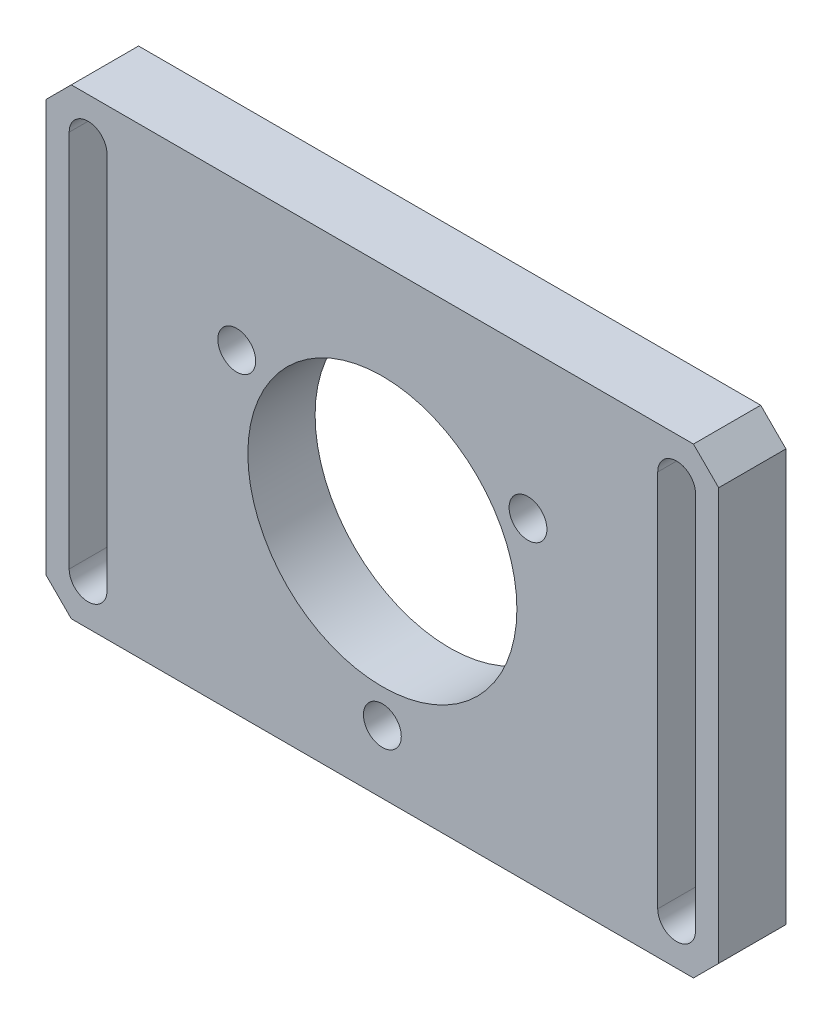
ISO-10303-21;
HEADER;
FILE_DESCRIPTION(('STEP AP214'),'2;1');
FILE_NAME('part.step','',(''),(''),'','','');
FILE_SCHEMA(('AUTOMOTIVE_DESIGN { 1 0 10303 214 1 1 1 1 }'));
ENDSEC;
DATA;
#1=APPLICATION_CONTEXT('core data for automotive mechanical design processes');
#2=APPLICATION_PROTOCOL_DEFINITION('international standard','automotive_design',2000,#1);
#3=PRODUCT_CONTEXT('',#1,'mechanical');
#4=PRODUCT('Part','Part','',(#3));
#5=PRODUCT_RELATED_PRODUCT_CATEGORY('part','',(#4));
#6=PRODUCT_DEFINITION_FORMATION('','',#4);
#7=PRODUCT_DEFINITION_CONTEXT('part definition',#1,'design');
#8=PRODUCT_DEFINITION('design','',#6,#7);
#9=PRODUCT_DEFINITION_SHAPE('','',#8);
#10=(LENGTH_UNIT() NAMED_UNIT(*) SI_UNIT(.MILLI.,.METRE.));
#11=(NAMED_UNIT(*) PLANE_ANGLE_UNIT() SI_UNIT($,.RADIAN.));
#12=(NAMED_UNIT(*) SI_UNIT($,.STERADIAN.) SOLID_ANGLE_UNIT());
#13=UNCERTAINTY_MEASURE_WITH_UNIT(LENGTH_MEASURE(1.E-05),#10,'distance_accuracy_value','');
#14=(GEOMETRIC_REPRESENTATION_CONTEXT(3) GLOBAL_UNCERTAINTY_ASSIGNED_CONTEXT((#13)) GLOBAL_UNIT_ASSIGNED_CONTEXT((#10,
#11,#12)) REPRESENTATION_CONTEXT('',''));
#15=CARTESIAN_POINT('',(0.,0.,0.));
#16=DIRECTION('',(0.,0.,1.));
#17=DIRECTION('',(1.,0.,0.));
#18=AXIS2_PLACEMENT_3D('',#15,#16,#17);
#19=CARTESIAN_POINT('',(-29.6552919780773,16.2728929963228,-8.));
#20=DIRECTION('',(-1.,0.,0.));
#21=DIRECTION('',(0.,-1.,0.));
#22=AXIS2_PLACEMENT_3D('',#19,#20,#21);
#23=PLANE('',#22);
#24=DIRECTION('',(0.,-1.,0.));
#25=VECTOR('',#24,1.);
#26=CARTESIAN_POINT('',(-29.6552919780773,16.2728929963228,-8.));
#27=LINE('',#26,#25);
#28=CARTESIAN_POINT('',(-29.6552919780773,13.2728929963228,-8.));
#29=VERTEX_POINT('',#28);
#30=CARTESIAN_POINT('',(-29.6552919780772,-35.7271070036772,-8.));
#31=VERTEX_POINT('',#30);
#32=EDGE_CURVE('E234',#29,#31,#27,.T.);
#33=ORIENTED_EDGE('',*,*,#32,.T.);
#34=DIRECTION('',(0.,0.,1.));
#35=VECTOR('',#34,1.);
#36=CARTESIAN_POINT('',(-29.6552919780772,-35.7271070036772,-8.));
#37=LINE('',#36,#35);
#38=CARTESIAN_POINT('',(-29.6552919780772,-35.7271070036772,0.));
#39=VERTEX_POINT('',#38);
#40=EDGE_CURVE('E11',#31,#39,#37,.T.);
#41=ORIENTED_EDGE('',*,*,#40,.T.);
#42=DIRECTION('',(0.,-1.,0.));
#43=VECTOR('',#42,1.);
#44=CARTESIAN_POINT('',(-29.6552919780773,16.2728929963228,0.));
#45=LINE('',#44,#43);
#46=CARTESIAN_POINT('',(-29.6552919780773,13.2728929963228,0.));
#47=VERTEX_POINT('',#46);
#48=EDGE_CURVE('E231',#47,#39,#45,.T.);
#49=ORIENTED_EDGE('',*,*,#48,.F.);
#50=DIRECTION('',(0.,0.,-1.));
#51=VECTOR('',#50,1.);
#52=CARTESIAN_POINT('',(-29.6552919780773,13.2728929963228,-8.));
#53=LINE('',#52,#51);
#54=EDGE_CURVE('E41',#47,#29,#53,.T.);
#55=ORIENTED_EDGE('',*,*,#54,.T.);
#56=EDGE_LOOP('',(#33,#41,#49,#55));
#57=FACE_BOUND('',#56,.T.);
#58=ADVANCED_FACE('F33',(#57),#23,.T.);
#59=CARTESIAN_POINT('',(-29.6552919780773,16.2728929963228,-8.));
#60=DIRECTION('',(0.,1.,0.));
#61=DIRECTION('',(0.,0.,1.));
#62=AXIS2_PLACEMENT_3D('',#59,#60,#61);
#63=PLANE('',#62);
#64=DIRECTION('',(-1.,0.,0.));
#65=VECTOR('',#64,1.);
#66=CARTESIAN_POINT('',(-29.6552919780773,16.2728929963228,0.));
#67=LINE('',#66,#65);
#68=CARTESIAN_POINT('',(47.3447080219227,16.2728929963228,0.));
#69=VERTEX_POINT('',#68);
#70=CARTESIAN_POINT('',(-26.6552919780772,16.2728929963228,0.));
#71=VERTEX_POINT('',#70);
#72=EDGE_CURVE('E238',#69,#71,#67,.T.);
#73=ORIENTED_EDGE('',*,*,#72,.F.);
#74=DIRECTION('',(0.,0.,-1.));
#75=VECTOR('',#74,1.);
#76=CARTESIAN_POINT('',(47.3447080219227,16.2728929963228,-8.));
#77=LINE('',#76,#75);
#78=CARTESIAN_POINT('',(47.3447080219227,16.2728929963228,-8.));
#79=VERTEX_POINT('',#78);
#80=EDGE_CURVE('E272',#69,#79,#77,.T.);
#81=ORIENTED_EDGE('',*,*,#80,.T.);
#82=DIRECTION('',(-1.,0.,0.));
#83=VECTOR('',#82,1.);
#84=CARTESIAN_POINT('',(-29.6552919780773,16.2728929963228,-8.));
#85=LINE('',#84,#83);
#86=CARTESIAN_POINT('',(-26.6552919780772,16.2728929963228,-8.));
#87=VERTEX_POINT('',#86);
#88=EDGE_CURVE('E243',#79,#87,#85,.T.);
#89=ORIENTED_EDGE('',*,*,#88,.T.);
#90=DIRECTION('',(0.,0.,1.));
#91=VECTOR('',#90,1.);
#92=CARTESIAN_POINT('',(-26.6552919780772,16.2728929963228,-8.));
#93=LINE('',#92,#91);
#94=EDGE_CURVE('E269',#87,#71,#93,.T.);
#95=ORIENTED_EDGE('',*,*,#94,.T.);
#96=EDGE_LOOP('',(#73,#81,#89,#95));
#97=FACE_BOUND('',#96,.T.);
#98=ADVANCED_FACE('F296',(#97),#63,.T.);
#99=CARTESIAN_POINT('',(50.3447080219227,16.2728929963228,-8.));
#100=DIRECTION('',(1.,0.,0.));
#101=DIRECTION('',(0.,1.,0.));
#102=AXIS2_PLACEMENT_3D('',#99,#100,#101);
#103=PLANE('',#102);
#104=DIRECTION('',(0.,1.,0.));
#105=VECTOR('',#104,1.);
#106=CARTESIAN_POINT('',(50.3447080219227,16.2728929963228,-8.));
#107=LINE('',#106,#105);
#108=CARTESIAN_POINT('',(50.3447080219227,-35.7271070036772,-8.));
#109=VERTEX_POINT('',#108);
#110=CARTESIAN_POINT('',(50.3447080219227,13.2728929963228,-8.));
#111=VERTEX_POINT('',#110);
#112=EDGE_CURVE('E240',#109,#111,#107,.T.);
#113=ORIENTED_EDGE('',*,*,#112,.T.);
#114=DIRECTION('',(0.,0.,1.));
#115=VECTOR('',#114,1.);
#116=CARTESIAN_POINT('',(50.3447080219227,13.2728929963228,-8.));
#117=LINE('',#116,#115);
#118=CARTESIAN_POINT('',(50.3447080219227,13.2728929963228,0.));
#119=VERTEX_POINT('',#118);
#120=EDGE_CURVE('E258',#111,#119,#117,.T.);
#121=ORIENTED_EDGE('',*,*,#120,.T.);
#122=DIRECTION('',(0.,1.,0.));
#123=VECTOR('',#122,1.);
#124=CARTESIAN_POINT('',(50.3447080219227,16.2728929963228,0.));
#125=LINE('',#124,#123);
#126=CARTESIAN_POINT('',(50.3447080219227,-35.7271070036772,0.));
#127=VERTEX_POINT('',#126);
#128=EDGE_CURVE('E252',#127,#119,#125,.T.);
#129=ORIENTED_EDGE('',*,*,#128,.F.);
#130=DIRECTION('',(0.,0.,-1.));
#131=VECTOR('',#130,1.);
#132=CARTESIAN_POINT('',(50.3447080219227,-35.7271070036772,-8.));
#133=LINE('',#132,#131);
#134=EDGE_CURVE('E246',#127,#109,#133,.T.);
#135=ORIENTED_EDGE('',*,*,#134,.T.);
#136=EDGE_LOOP('',(#113,#121,#129,#135));
#137=FACE_BOUND('',#136,.T.);
#138=ADVANCED_FACE('F306',(#137),#103,.T.);
#139=CARTESIAN_POINT('',(-29.6552919780772,-38.7271070036772,-8.));
#140=DIRECTION('',(0.,-1.,0.));
#141=DIRECTION('',(0.,0.,-1.));
#142=AXIS2_PLACEMENT_3D('',#139,#140,#141);
#143=PLANE('',#142);
#144=DIRECTION('',(1.,0.,0.));
#145=VECTOR('',#144,1.);
#146=CARTESIAN_POINT('',(-29.6552919780772,-38.7271070036772,-8.));
#147=LINE('',#146,#145);
#148=CARTESIAN_POINT('',(-26.6552919780772,-38.7271070036772,-8.));
#149=VERTEX_POINT('',#148);
#150=CARTESIAN_POINT('',(47.3447080219227,-38.7271070036772,-8.));
#151=VERTEX_POINT('',#150);
#152=EDGE_CURVE('E237',#149,#151,#147,.T.);
#153=ORIENTED_EDGE('',*,*,#152,.T.);
#154=DIRECTION('',(0.,0.,1.));
#155=VECTOR('',#154,1.);
#156=CARTESIAN_POINT('',(47.3447080219227,-38.7271070036772,-8.));
#157=LINE('',#156,#155);
#158=CARTESIAN_POINT('',(47.3447080219227,-38.7271070036772,0.));
#159=VERTEX_POINT('',#158);
#160=EDGE_CURVE('E282',#151,#159,#157,.T.);
#161=ORIENTED_EDGE('',*,*,#160,.T.);
#162=DIRECTION('',(1.,0.,0.));
#163=VECTOR('',#162,1.);
#164=CARTESIAN_POINT('',(-29.6552919780772,-38.7271070036772,0.));
#165=LINE('',#164,#163);
#166=CARTESIAN_POINT('',(-26.6552919780772,-38.7271070036772,0.));
#167=VERTEX_POINT('',#166);
#168=EDGE_CURVE('E249',#167,#159,#165,.T.);
#169=ORIENTED_EDGE('',*,*,#168,.F.);
#170=DIRECTION('',(0.,0.,-1.));
#171=VECTOR('',#170,1.);
#172=CARTESIAN_POINT('',(-26.6552919780772,-38.7271070036772,-8.));
#173=LINE('',#172,#171);
#174=EDGE_CURVE('E55',#167,#149,#173,.T.);
#175=ORIENTED_EDGE('',*,*,#174,.T.);
#176=EDGE_LOOP('',(#153,#161,#169,#175));
#177=FACE_BOUND('',#176,.T.);
#178=ADVANCED_FACE('F311',(#177),#143,.T.);
#179=CARTESIAN_POINT('',(0.,0.,-8.));
#180=DIRECTION('',(0.,0.,1.));
#181=DIRECTION('',(1.,0.,0.));
#182=AXIS2_PLACEMENT_3D('',#179,#180,#181);
#183=PLANE('',#182);
#184=CARTESIAN_POINT('',(27.6652160976116,-1.22710700367738,-8.));
#185=DIRECTION('',(0.,0.,1.));
#186=DIRECTION('',(-0.499999999999992,0.866025403784443,0.));
#187=AXIS2_PLACEMENT_3D('',#184,#185,#186);
#188=CIRCLE('',#187,2.25);
#189=CARTESIAN_POINT('',(26.5402160976116,0.721450154837616,-8.));
#190=VERTEX_POINT('',#189);
#191=EDGE_CURVE('E546',#190,#190,#188,.T.);
#192=ORIENTED_EDGE('',*,*,#191,.T.);
#193=EDGE_LOOP('',(#192));
#194=FACE_BOUND('',#193,.T.);
#195=CARTESIAN_POINT('',(-6.97580005376599,-1.22710700367714,-8.));
#196=DIRECTION('',(0.,0.,1.));
#197=DIRECTION('',(-0.500000000000004,-0.866025403784436,0.));
#198=AXIS2_PLACEMENT_3D('',#195,#196,#197);
#199=CIRCLE('',#198,2.25);
#200=CARTESIAN_POINT('',(-8.100800053766,-3.17566416219212,-8.));
#201=VERTEX_POINT('',#200);
#202=EDGE_CURVE('E540',#201,#201,#199,.T.);
#203=ORIENTED_EDGE('',*,*,#202,.T.);
#204=EDGE_LOOP('',(#203));
#205=FACE_BOUND('',#204,.T.);
#206=CARTESIAN_POINT('',(10.3447080219227,-31.2271070036772,-8.));
#207=DIRECTION('',(0.,0.,1.));
#208=DIRECTION('',(1.,0.,0.));
#209=AXIS2_PLACEMENT_3D('',#206,#207,#208);
#210=CIRCLE('',#209,2.25);
#211=CARTESIAN_POINT('',(12.5947080219228,-31.2271070036772,-8.));
#212=VERTEX_POINT('',#211);
#213=EDGE_CURVE('E186',#212,#212,#210,.T.);
#214=ORIENTED_EDGE('',*,*,#213,.T.);
#215=EDGE_LOOP('',(#214));
#216=FACE_BOUND('',#215,.T.);
#217=DIRECTION('',(0.,1.,0.));
#218=VECTOR('',#217,1.);
#219=CARTESIAN_POINT('',(47.5947080219228,11.2728929963228,-8.));
#220=LINE('',#219,#218);
#221=CARTESIAN_POINT('',(47.5947080219228,-33.7271070036772,-8.));
#222=VERTEX_POINT('',#221);
#223=CARTESIAN_POINT('',(47.5947080219228,11.2728929963228,-8.));
#224=VERTEX_POINT('',#223);
#225=EDGE_CURVE('E160',#222,#224,#220,.T.);
#226=ORIENTED_EDGE('',*,*,#225,.T.);
#227=CARTESIAN_POINT('',(45.3447080219228,11.2728929963228,-8.));
#228=DIRECTION('',(0.,0.,1.));
#229=DIRECTION('',(1.,0.,0.));
#230=AXIS2_PLACEMENT_3D('',#227,#228,#229);
#231=CIRCLE('',#230,2.25);
#232=CARTESIAN_POINT('',(43.0947080219227,11.2728929963228,-8.));
#233=VERTEX_POINT('',#232);
#234=EDGE_CURVE('E152',#224,#233,#231,.T.);
#235=ORIENTED_EDGE('',*,*,#234,.T.);
#236=DIRECTION('',(0.,-1.,0.));
#237=VECTOR('',#236,1.);
#238=CARTESIAN_POINT('',(43.0947080219227,11.2728929963228,-8.));
#239=LINE('',#238,#237);
#240=CARTESIAN_POINT('',(43.0947080219227,-33.7271070036772,-8.));
#241=VERTEX_POINT('',#240);
#242=EDGE_CURVE('E164',#233,#241,#239,.T.);
#243=ORIENTED_EDGE('',*,*,#242,.T.);
#244=CARTESIAN_POINT('',(45.3447080219228,-33.7271070036772,-8.));
#245=DIRECTION('',(0.,0.,1.));
#246=DIRECTION('',(1.,0.,0.));
#247=AXIS2_PLACEMENT_3D('',#244,#245,#246);
#248=CIRCLE('',#247,2.25000000000001);
#249=EDGE_CURVE('E168',#241,#222,#248,.T.);
#250=ORIENTED_EDGE('',*,*,#249,.T.);
#251=EDGE_LOOP('',(#226,#235,#243,#250));
#252=FACE_BOUND('',#251,.T.);
#253=DIRECTION('',(0.,1.,0.));
#254=VECTOR('',#253,1.);
#255=CARTESIAN_POINT('',(-22.4052919780773,11.2728929963228,-8.));
#256=LINE('',#255,#254);
#257=CARTESIAN_POINT('',(-22.4052919780772,-33.7271070036772,-8.));
#258=VERTEX_POINT('',#257);
#259=CARTESIAN_POINT('',(-22.4052919780773,11.2728929963228,-8.));
#260=VERTEX_POINT('',#259);
#261=EDGE_CURVE('E206',#258,#260,#256,.T.);
#262=ORIENTED_EDGE('',*,*,#261,.T.);
#263=CARTESIAN_POINT('',(-24.6552919780773,11.2728929963228,-8.));
#264=DIRECTION('',(0.,0.,1.));
#265=DIRECTION('',(1.,0.,0.));
#266=AXIS2_PLACEMENT_3D('',#263,#264,#265);
#267=CIRCLE('',#266,2.25);
#268=CARTESIAN_POINT('',(-26.9052919780773,11.2728929963228,-8.));
#269=VERTEX_POINT('',#268);
#270=EDGE_CURVE('E196',#260,#269,#267,.T.);
#271=ORIENTED_EDGE('',*,*,#270,.T.);
#272=DIRECTION('',(0.,-1.,0.));
#273=VECTOR('',#272,1.);
#274=CARTESIAN_POINT('',(-26.9052919780773,11.2728929963228,-8.));
#275=LINE('',#274,#273);
#276=CARTESIAN_POINT('',(-26.9052919780772,-33.7271070036772,-8.));
#277=VERTEX_POINT('',#276);
#278=EDGE_CURVE('E199',#269,#277,#275,.T.);
#279=ORIENTED_EDGE('',*,*,#278,.T.);
#280=CARTESIAN_POINT('',(-24.6552919780772,-33.7271070036772,-8.));
#281=DIRECTION('',(0.,0.,1.));
#282=DIRECTION('',(1.,0.,0.));
#283=AXIS2_PLACEMENT_3D('',#280,#281,#282);
#284=CIRCLE('',#283,2.25);
#285=EDGE_CURVE('E203',#277,#258,#284,.T.);
#286=ORIENTED_EDGE('',*,*,#285,.T.);
#287=EDGE_LOOP('',(#262,#271,#279,#286));
#288=FACE_BOUND('',#287,.T.);
#289=CARTESIAN_POINT('',(10.3447080219227,-11.2271070036772,-8.));
#290=DIRECTION('',(0.,0.,1.));
#291=DIRECTION('',(1.,0.,0.));
#292=AXIS2_PLACEMENT_3D('',#289,#290,#291);
#293=CIRCLE('',#292,16.);
#294=CARTESIAN_POINT('',(26.3447080219228,-11.2271070036772,-8.));
#295=VERTEX_POINT('',#294);
#296=EDGE_CURVE('E228',#295,#295,#293,.T.);
#297=ORIENTED_EDGE('',*,*,#296,.T.);
#298=EDGE_LOOP('',(#297));
#299=FACE_BOUND('',#298,.T.);
#300=ORIENTED_EDGE('',*,*,#88,.F.);
#301=DIRECTION('',(-0.707106781186549,0.707106781186546,0.));
#302=VECTOR('',#301,1.);
#303=CARTESIAN_POINT('',(50.3447080219227,13.2728929963228,-8.));
#304=LINE('',#303,#302);
#305=EDGE_CURVE('E279',#79,#111,#304,.F.);
#306=ORIENTED_EDGE('',*,*,#305,.T.);
#307=ORIENTED_EDGE('',*,*,#112,.F.);
#308=DIRECTION('',(0.707106781186546,0.707106781186549,0.));
#309=VECTOR('',#308,1.);
#310=CARTESIAN_POINT('',(47.3447080219227,-38.7271070036772,-8.));
#311=LINE('',#310,#309);
#312=EDGE_CURVE('E48',#109,#151,#311,.F.);
#313=ORIENTED_EDGE('',*,*,#312,.T.);
#314=ORIENTED_EDGE('',*,*,#152,.F.);
#315=DIRECTION('',(0.707106781186549,-0.707106781186546,0.));
#316=VECTOR('',#315,1.);
#317=CARTESIAN_POINT('',(-29.6552919780772,-35.7271070036772,-8.));
#318=LINE('',#317,#316);
#319=EDGE_CURVE('E276',#149,#31,#318,.F.);
#320=ORIENTED_EDGE('',*,*,#319,.T.);
#321=ORIENTED_EDGE('',*,*,#32,.F.);
#322=DIRECTION('',(-0.707106781186546,-0.707106781186549,0.));
#323=VECTOR('',#322,1.);
#324=CARTESIAN_POINT('',(-26.6552919780772,16.2728929963228,-8.));
#325=LINE('',#324,#323);
#326=EDGE_CURVE('E274',#29,#87,#325,.F.);
#327=ORIENTED_EDGE('',*,*,#326,.T.);
#328=EDGE_LOOP('',(#300,#306,#307,#313,#314,#320,#321,#327));
#329=FACE_BOUND('',#328,.T.);
#330=ADVANCED_FACE('F170',(#194,#205,#216,#252,#288,#299,#329),#183,.F.);
#331=CARTESIAN_POINT('',(0.,0.,0.));
#332=DIRECTION('',(0.,0.,1.));
#333=DIRECTION('',(1.,0.,0.));
#334=AXIS2_PLACEMENT_3D('',#331,#332,#333);
#335=PLANE('',#334);
#336=CARTESIAN_POINT('',(27.6652160976116,-1.22710700367738,0.));
#337=DIRECTION('',(0.,0.,1.));
#338=DIRECTION('',(-0.499999999999992,0.866025403784443,0.));
#339=AXIS2_PLACEMENT_3D('',#336,#337,#338);
#340=CIRCLE('',#339,2.25);
#341=CARTESIAN_POINT('',(26.5402160976116,0.721450154837616,0.));
#342=VERTEX_POINT('',#341);
#343=EDGE_CURVE('E515',#342,#342,#340,.T.);
#344=ORIENTED_EDGE('',*,*,#343,.F.);
#345=EDGE_LOOP('',(#344));
#346=FACE_BOUND('',#345,.T.);
#347=CARTESIAN_POINT('',(-6.97580005376599,-1.22710700367714,0.));
#348=DIRECTION('',(0.,0.,1.));
#349=DIRECTION('',(-0.500000000000004,-0.866025403784436,0.));
#350=AXIS2_PLACEMENT_3D('',#347,#348,#349);
#351=CIRCLE('',#350,2.25);
#352=CARTESIAN_POINT('',(-8.100800053766,-3.17566416219212,0.));
#353=VERTEX_POINT('',#352);
#354=EDGE_CURVE('E519',#353,#353,#351,.T.);
#355=ORIENTED_EDGE('',*,*,#354,.F.);
#356=EDGE_LOOP('',(#355));
#357=FACE_BOUND('',#356,.T.);
#358=CARTESIAN_POINT('',(10.3447080219227,-31.2271070036772,0.));
#359=DIRECTION('',(0.,0.,1.));
#360=DIRECTION('',(1.,0.,0.));
#361=AXIS2_PLACEMENT_3D('',#358,#359,#360);
#362=CIRCLE('',#361,2.25);
#363=CARTESIAN_POINT('',(12.5947080219228,-31.2271070036772,0.));
#364=VERTEX_POINT('',#363);
#365=EDGE_CURVE('E179',#364,#364,#362,.T.);
#366=ORIENTED_EDGE('',*,*,#365,.F.);
#367=EDGE_LOOP('',(#366));
#368=FACE_BOUND('',#367,.T.);
#369=CARTESIAN_POINT('',(45.3447080219228,11.2728929963228,0.));
#370=DIRECTION('',(0.,0.,1.));
#371=DIRECTION('',(1.,0.,0.));
#372=AXIS2_PLACEMENT_3D('',#369,#370,#371);
#373=CIRCLE('',#372,2.25);
#374=CARTESIAN_POINT('',(47.5947080219228,11.2728929963228,0.));
#375=VERTEX_POINT('',#374);
#376=CARTESIAN_POINT('',(43.0947080219227,11.2728929963228,0.));
#377=VERTEX_POINT('',#376);
#378=EDGE_CURVE('E155',#375,#377,#373,.T.);
#379=ORIENTED_EDGE('',*,*,#378,.F.);
#380=DIRECTION('',(0.,1.,0.));
#381=VECTOR('',#380,1.);
#382=CARTESIAN_POINT('',(47.5947080219228,11.2728929963228,0.));
#383=LINE('',#382,#381);
#384=CARTESIAN_POINT('',(47.5947080219228,-33.7271070036772,0.));
#385=VERTEX_POINT('',#384);
#386=EDGE_CURVE('E173',#385,#375,#383,.T.);
#387=ORIENTED_EDGE('',*,*,#386,.F.);
#388=CARTESIAN_POINT('',(45.3447080219228,-33.7271070036772,0.));
#389=DIRECTION('',(0.,0.,1.));
#390=DIRECTION('',(1.,0.,0.));
#391=AXIS2_PLACEMENT_3D('',#388,#389,#390);
#392=CIRCLE('',#391,2.25000000000001);
#393=CARTESIAN_POINT('',(43.0947080219227,-33.7271070036772,0.));
#394=VERTEX_POINT('',#393);
#395=EDGE_CURVE('E176',#394,#385,#392,.T.);
#396=ORIENTED_EDGE('',*,*,#395,.F.);
#397=DIRECTION('',(0.,-1.,0.));
#398=VECTOR('',#397,1.);
#399=CARTESIAN_POINT('',(43.0947080219227,11.2728929963228,0.));
#400=LINE('',#399,#398);
#401=EDGE_CURVE('E185',#377,#394,#400,.T.);
#402=ORIENTED_EDGE('',*,*,#401,.F.);
#403=EDGE_LOOP('',(#379,#387,#396,#402));
#404=FACE_BOUND('',#403,.T.);
#405=CARTESIAN_POINT('',(-24.6552919780773,11.2728929963228,0.));
#406=DIRECTION('',(0.,0.,1.));
#407=DIRECTION('',(1.,0.,0.));
#408=AXIS2_PLACEMENT_3D('',#405,#406,#407);
#409=CIRCLE('',#408,2.25);
#410=CARTESIAN_POINT('',(-22.4052919780773,11.2728929963228,0.));
#411=VERTEX_POINT('',#410);
#412=CARTESIAN_POINT('',(-26.9052919780773,11.2728929963228,0.));
#413=VERTEX_POINT('',#412);
#414=EDGE_CURVE('E192',#411,#413,#409,.T.);
#415=ORIENTED_EDGE('',*,*,#414,.F.);
#416=DIRECTION('',(0.,1.,0.));
#417=VECTOR('',#416,1.);
#418=CARTESIAN_POINT('',(-22.4052919780773,11.2728929963228,0.));
#419=LINE('',#418,#417);
#420=CARTESIAN_POINT('',(-22.4052919780772,-33.7271070036772,0.));
#421=VERTEX_POINT('',#420);
#422=EDGE_CURVE('E200',#421,#411,#419,.T.);
#423=ORIENTED_EDGE('',*,*,#422,.F.);
#424=CARTESIAN_POINT('',(-24.6552919780772,-33.7271070036772,0.));
#425=DIRECTION('',(0.,0.,1.));
#426=DIRECTION('',(1.,0.,0.));
#427=AXIS2_PLACEMENT_3D('',#424,#425,#426);
#428=CIRCLE('',#427,2.25);
#429=CARTESIAN_POINT('',(-26.9052919780772,-33.7271070036772,0.));
#430=VERTEX_POINT('',#429);
#431=EDGE_CURVE('E214',#430,#421,#428,.T.);
#432=ORIENTED_EDGE('',*,*,#431,.F.);
#433=DIRECTION('',(0.,-1.,0.));
#434=VECTOR('',#433,1.);
#435=CARTESIAN_POINT('',(-26.9052919780773,11.2728929963228,0.));
#436=LINE('',#435,#434);
#437=EDGE_CURVE('E211',#413,#430,#436,.T.);
#438=ORIENTED_EDGE('',*,*,#437,.F.);
#439=EDGE_LOOP('',(#415,#423,#432,#438));
#440=FACE_BOUND('',#439,.T.);
#441=CARTESIAN_POINT('',(10.3447080219227,-11.2271070036772,0.));
#442=DIRECTION('',(0.,0.,1.));
#443=DIRECTION('',(1.,0.,0.));
#444=AXIS2_PLACEMENT_3D('',#441,#442,#443);
#445=CIRCLE('',#444,16.);
#446=CARTESIAN_POINT('',(26.3447080219228,-11.2271070036772,0.));
#447=VERTEX_POINT('',#446);
#448=EDGE_CURVE('E221',#447,#447,#445,.T.);
#449=ORIENTED_EDGE('',*,*,#448,.F.);
#450=EDGE_LOOP('',(#449));
#451=FACE_BOUND('',#450,.T.);
#452=ORIENTED_EDGE('',*,*,#128,.T.);
#453=DIRECTION('',(0.707106781186549,-0.707106781186546,0.));
#454=VECTOR('',#453,1.);
#455=CARTESIAN_POINT('',(31.8088005091227,31.8088005091228,0.));
#456=LINE('',#455,#454);
#457=EDGE_CURVE('E267',#119,#69,#456,.F.);
#458=ORIENTED_EDGE('',*,*,#457,.T.);
#459=ORIENTED_EDGE('',*,*,#72,.T.);
#460=DIRECTION('',(0.707106781186546,0.707106781186549,0.));
#461=VECTOR('',#460,1.);
#462=CARTESIAN_POINT('',(-21.4640924872001,21.4640924872,0.));
#463=LINE('',#462,#461);
#464=EDGE_CURVE('E261',#71,#47,#463,.F.);
#465=ORIENTED_EDGE('',*,*,#464,.T.);
#466=ORIENTED_EDGE('',*,*,#48,.T.);
#467=DIRECTION('',(-0.707106781186549,0.707106781186546,0.));
#468=VECTOR('',#467,1.);
#469=CARTESIAN_POINT('',(-32.6911994908772,-32.6911994908773,0.));
#470=LINE('',#469,#468);
#471=EDGE_CURVE('E263',#39,#167,#470,.F.);
#472=ORIENTED_EDGE('',*,*,#471,.T.);
#473=ORIENTED_EDGE('',*,*,#168,.T.);
#474=DIRECTION('',(-0.707106781186546,-0.707106781186549,0.));
#475=VECTOR('',#474,1.);
#476=CARTESIAN_POINT('',(43.0359075128001,-43.0359075127999,0.));
#477=LINE('',#476,#475);
#478=EDGE_CURVE('E265',#159,#127,#477,.F.);
#479=ORIENTED_EDGE('',*,*,#478,.T.);
#480=EDGE_LOOP('',(#452,#458,#459,#465,#466,#472,#473,#479));
#481=FACE_BOUND('',#480,.T.);
#482=ADVANCED_FACE('F299',(#346,#357,#368,#404,#440,#451,#481),#335,.T.);
#483=CARTESIAN_POINT('',(10.3447080219227,-11.2271070036772,-8.));
#484=DIRECTION('',(0.,0.,1.));
#485=DIRECTION('',(1.,0.,0.));
#486=AXIS2_PLACEMENT_3D('',#483,#484,#485);
#487=CYLINDRICAL_SURFACE('',#486,16.);
#488=ORIENTED_EDGE('',*,*,#296,.F.);
#489=EDGE_LOOP('',(#488));
#490=FACE_BOUND('',#489,.T.);
#491=ORIENTED_EDGE('',*,*,#448,.T.);
#492=EDGE_LOOP('',(#491));
#493=FACE_BOUND('',#492,.T.);
#494=ADVANCED_FACE('F376',(#490,#493),#487,.F.);
#495=CARTESIAN_POINT('',(-24.6552919780773,11.2728929963228,-8.));
#496=DIRECTION('',(0.,0.,1.));
#497=DIRECTION('',(1.,0.,0.));
#498=AXIS2_PLACEMENT_3D('',#495,#496,#497);
#499=CYLINDRICAL_SURFACE('',#498,2.25);
#500=ORIENTED_EDGE('',*,*,#414,.T.);
#501=DIRECTION('',(0.,0.,1.));
#502=VECTOR('',#501,1.);
#503=CARTESIAN_POINT('',(-26.9052919780773,11.2728929963228,-8.));
#504=LINE('',#503,#502);
#505=EDGE_CURVE('E209',#269,#413,#504,.T.);
#506=ORIENTED_EDGE('',*,*,#505,.F.);
#507=ORIENTED_EDGE('',*,*,#270,.F.);
#508=DIRECTION('',(0.,0.,1.));
#509=VECTOR('',#508,1.);
#510=CARTESIAN_POINT('',(-22.4052919780773,11.2728929963228,-8.));
#511=LINE('',#510,#509);
#512=EDGE_CURVE('E219',#260,#411,#511,.T.);
#513=ORIENTED_EDGE('',*,*,#512,.T.);
#514=EDGE_LOOP('',(#500,#506,#507,#513));
#515=FACE_BOUND('',#514,.T.);
#516=ADVANCED_FACE('F366',(#515),#499,.F.);
#517=CARTESIAN_POINT('',(-22.4052919780773,11.2728929963228,-8.));
#518=DIRECTION('',(1.,0.,0.));
#519=DIRECTION('',(0.,1.,0.));
#520=AXIS2_PLACEMENT_3D('',#517,#518,#519);
#521=PLANE('',#520);
#522=ORIENTED_EDGE('',*,*,#422,.T.);
#523=ORIENTED_EDGE('',*,*,#512,.F.);
#524=ORIENTED_EDGE('',*,*,#261,.F.);
#525=DIRECTION('',(0.,0.,1.));
#526=VECTOR('',#525,1.);
#527=CARTESIAN_POINT('',(-22.4052919780772,-33.7271070036772,-8.));
#528=LINE('',#527,#526);
#529=EDGE_CURVE('E222',#258,#421,#528,.T.);
#530=ORIENTED_EDGE('',*,*,#529,.T.);
#531=EDGE_LOOP('',(#522,#523,#524,#530));
#532=FACE_BOUND('',#531,.T.);
#533=ADVANCED_FACE('F362',(#532),#521,.F.);
#534=CARTESIAN_POINT('',(-24.6552919780772,-33.7271070036772,-8.));
#535=DIRECTION('',(0.,0.,1.));
#536=DIRECTION('',(1.,0.,0.));
#537=AXIS2_PLACEMENT_3D('',#534,#535,#536);
#538=CYLINDRICAL_SURFACE('',#537,2.25);
#539=ORIENTED_EDGE('',*,*,#431,.T.);
#540=ORIENTED_EDGE('',*,*,#529,.F.);
#541=ORIENTED_EDGE('',*,*,#285,.F.);
#542=DIRECTION('',(0.,0.,1.));
#543=VECTOR('',#542,1.);
#544=CARTESIAN_POINT('',(-26.9052919780772,-33.7271070036772,-8.));
#545=LINE('',#544,#543);
#546=EDGE_CURVE('E224',#277,#430,#545,.T.);
#547=ORIENTED_EDGE('',*,*,#546,.T.);
#548=EDGE_LOOP('',(#539,#540,#541,#547));
#549=FACE_BOUND('',#548,.T.);
#550=ADVANCED_FACE('F365',(#549),#538,.F.);
#551=CARTESIAN_POINT('',(-26.9052919780773,11.2728929963228,-8.));
#552=DIRECTION('',(-1.,0.,0.));
#553=DIRECTION('',(0.,-1.,0.));
#554=AXIS2_PLACEMENT_3D('',#551,#552,#553);
#555=PLANE('',#554);
#556=ORIENTED_EDGE('',*,*,#437,.T.);
#557=ORIENTED_EDGE('',*,*,#546,.F.);
#558=ORIENTED_EDGE('',*,*,#278,.F.);
#559=ORIENTED_EDGE('',*,*,#505,.T.);
#560=EDGE_LOOP('',(#556,#557,#558,#559));
#561=FACE_BOUND('',#560,.T.);
#562=ADVANCED_FACE('F361',(#561),#555,.F.);
#563=CARTESIAN_POINT('',(45.3447080219228,11.2728929963228,-8.));
#564=DIRECTION('',(0.,0.,1.));
#565=DIRECTION('',(1.,0.,0.));
#566=AXIS2_PLACEMENT_3D('',#563,#564,#565);
#567=CYLINDRICAL_SURFACE('',#566,2.25);
#568=ORIENTED_EDGE('',*,*,#378,.T.);
#569=DIRECTION('',(0.,0.,1.));
#570=VECTOR('',#569,1.);
#571=CARTESIAN_POINT('',(43.0947080219227,11.2728929963228,-8.));
#572=LINE('',#571,#570);
#573=EDGE_CURVE('E148',#233,#377,#572,.T.);
#574=ORIENTED_EDGE('',*,*,#573,.F.);
#575=ORIENTED_EDGE('',*,*,#234,.F.);
#576=DIRECTION('',(0.,0.,1.));
#577=VECTOR('',#576,1.);
#578=CARTESIAN_POINT('',(47.5947080219228,11.2728929963228,-8.));
#579=LINE('',#578,#577);
#580=EDGE_CURVE('E190',#224,#375,#579,.T.);
#581=ORIENTED_EDGE('',*,*,#580,.T.);
#582=EDGE_LOOP('',(#568,#574,#575,#581));
#583=FACE_BOUND('',#582,.T.);
#584=ADVANCED_FACE('F150',(#583),#567,.F.);
#585=CARTESIAN_POINT('',(47.5947080219228,11.2728929963228,-8.));
#586=DIRECTION('',(1.,0.,0.));
#587=DIRECTION('',(0.,1.,0.));
#588=AXIS2_PLACEMENT_3D('',#585,#586,#587);
#589=PLANE('',#588);
#590=ORIENTED_EDGE('',*,*,#386,.T.);
#591=ORIENTED_EDGE('',*,*,#580,.F.);
#592=ORIENTED_EDGE('',*,*,#225,.F.);
#593=DIRECTION('',(0.,0.,1.));
#594=VECTOR('',#593,1.);
#595=CARTESIAN_POINT('',(47.5947080219228,-33.7271070036772,-8.));
#596=LINE('',#595,#594);
#597=EDGE_CURVE('E193',#222,#385,#596,.T.);
#598=ORIENTED_EDGE('',*,*,#597,.T.);
#599=EDGE_LOOP('',(#590,#591,#592,#598));
#600=FACE_BOUND('',#599,.T.);
#601=ADVANCED_FACE('F349',(#600),#589,.F.);
#602=CARTESIAN_POINT('',(45.3447080219228,-33.7271070036772,-8.));
#603=DIRECTION('',(0.,0.,1.));
#604=DIRECTION('',(1.,0.,0.));
#605=AXIS2_PLACEMENT_3D('',#602,#603,#604);
#606=CYLINDRICAL_SURFACE('',#605,2.25000000000001);
#607=ORIENTED_EDGE('',*,*,#395,.T.);
#608=ORIENTED_EDGE('',*,*,#597,.F.);
#609=ORIENTED_EDGE('',*,*,#249,.F.);
#610=DIRECTION('',(0.,0.,1.));
#611=VECTOR('',#610,1.);
#612=CARTESIAN_POINT('',(43.0947080219227,-33.7271070036772,-8.));
#613=LINE('',#612,#611);
#614=EDGE_CURVE('E159',#241,#394,#613,.T.);
#615=ORIENTED_EDGE('',*,*,#614,.T.);
#616=EDGE_LOOP('',(#607,#608,#609,#615));
#617=FACE_BOUND('',#616,.T.);
#618=ADVANCED_FACE('F352',(#617),#606,.F.);
#619=CARTESIAN_POINT('',(43.0947080219227,11.2728929963228,-8.));
#620=DIRECTION('',(-1.,0.,0.));
#621=DIRECTION('',(0.,0.,1.));
#622=AXIS2_PLACEMENT_3D('',#619,#620,#621);
#623=PLANE('',#622);
#624=ORIENTED_EDGE('',*,*,#401,.T.);
#625=ORIENTED_EDGE('',*,*,#614,.F.);
#626=ORIENTED_EDGE('',*,*,#242,.F.);
#627=ORIENTED_EDGE('',*,*,#573,.T.);
#628=EDGE_LOOP('',(#624,#625,#626,#627));
#629=FACE_BOUND('',#628,.T.);
#630=ADVANCED_FACE('F165',(#629),#623,.F.);
#631=CARTESIAN_POINT('',(10.3447080219227,-31.2271070036772,-8.));
#632=DIRECTION('',(0.,0.,1.));
#633=DIRECTION('',(1.,0.,0.));
#634=AXIS2_PLACEMENT_3D('',#631,#632,#633);
#635=CYLINDRICAL_SURFACE('',#634,2.25);
#636=ORIENTED_EDGE('',*,*,#213,.F.);
#637=EDGE_LOOP('',(#636));
#638=FACE_BOUND('',#637,.T.);
#639=ORIENTED_EDGE('',*,*,#365,.T.);
#640=EDGE_LOOP('',(#639));
#641=FACE_BOUND('',#640,.T.);
#642=ADVANCED_FACE('F340',(#638,#641),#635,.F.);
#643=CARTESIAN_POINT('',(-6.97580005376599,-1.22710700367714,-8.));
#644=DIRECTION('',(0.,0.,1.));
#645=DIRECTION('',(1.,0.,0.));
#646=AXIS2_PLACEMENT_3D('',#643,#644,#645);
#647=CYLINDRICAL_SURFACE('',#646,2.25);
#648=ORIENTED_EDGE('',*,*,#202,.F.);
#649=EDGE_LOOP('',(#648));
#650=FACE_BOUND('',#649,.T.);
#651=ORIENTED_EDGE('',*,*,#354,.T.);
#652=EDGE_LOOP('',(#651));
#653=FACE_BOUND('',#652,.T.);
#654=ADVANCED_FACE('F334',(#650,#653),#647,.F.);
#655=CARTESIAN_POINT('',(27.6652160976116,-1.22710700367738,-8.));
#656=DIRECTION('',(0.,0.,1.));
#657=DIRECTION('',(1.,0.,0.));
#658=AXIS2_PLACEMENT_3D('',#655,#656,#657);
#659=CYLINDRICAL_SURFACE('',#658,2.25);
#660=ORIENTED_EDGE('',*,*,#191,.F.);
#661=EDGE_LOOP('',(#660));
#662=FACE_BOUND('',#661,.T.);
#663=ORIENTED_EDGE('',*,*,#343,.T.);
#664=EDGE_LOOP('',(#663));
#665=FACE_BOUND('',#664,.T.);
#666=ADVANCED_FACE('F330',(#662,#665),#659,.F.);
#667=CARTESIAN_POINT('',(50.3447080219227,13.2728929963228,-8.));
#668=DIRECTION('',(-0.707106781186546,-0.707106781186549,0.));
#669=DIRECTION('',(0.,0.,1.));
#670=AXIS2_PLACEMENT_3D('',#667,#668,#669);
#671=PLANE('',#670);
#672=ORIENTED_EDGE('',*,*,#305,.F.);
#673=ORIENTED_EDGE('',*,*,#80,.F.);
#674=ORIENTED_EDGE('',*,*,#457,.F.);
#675=ORIENTED_EDGE('',*,*,#120,.F.);
#676=EDGE_LOOP('',(#672,#673,#674,#675));
#677=FACE_BOUND('',#676,.T.);
#678=ADVANCED_FACE('F304',(#677),#671,.F.);
#679=CARTESIAN_POINT('',(47.3447080219227,-38.7271070036772,-8.));
#680=DIRECTION('',(-0.707106781186549,0.707106781186546,0.));
#681=DIRECTION('',(0.,0.,1.));
#682=AXIS2_PLACEMENT_3D('',#679,#680,#681);
#683=PLANE('',#682);
#684=ORIENTED_EDGE('',*,*,#312,.F.);
#685=ORIENTED_EDGE('',*,*,#134,.F.);
#686=ORIENTED_EDGE('',*,*,#478,.F.);
#687=ORIENTED_EDGE('',*,*,#160,.F.);
#688=EDGE_LOOP('',(#684,#685,#686,#687));
#689=FACE_BOUND('',#688,.T.);
#690=ADVANCED_FACE('F310',(#689),#683,.F.);
#691=CARTESIAN_POINT('',(-29.6552919780772,-35.7271070036772,-8.));
#692=DIRECTION('',(0.707106781186546,0.707106781186549,0.));
#693=DIRECTION('',(0.,0.,1.));
#694=AXIS2_PLACEMENT_3D('',#691,#692,#693);
#695=PLANE('',#694);
#696=ORIENTED_EDGE('',*,*,#319,.F.);
#697=ORIENTED_EDGE('',*,*,#174,.F.);
#698=ORIENTED_EDGE('',*,*,#471,.F.);
#699=ORIENTED_EDGE('',*,*,#40,.F.);
#700=EDGE_LOOP('',(#696,#697,#698,#699));
#701=FACE_BOUND('',#700,.T.);
#702=ADVANCED_FACE('F313',(#701),#695,.F.);
#703=CARTESIAN_POINT('',(-26.6552919780772,16.2728929963228,-8.));
#704=DIRECTION('',(0.707106781186549,-0.707106781186546,0.));
#705=DIRECTION('',(0.,0.,1.));
#706=AXIS2_PLACEMENT_3D('',#703,#704,#705);
#707=PLANE('',#706);
#708=ORIENTED_EDGE('',*,*,#326,.F.);
#709=ORIENTED_EDGE('',*,*,#54,.F.);
#710=ORIENTED_EDGE('',*,*,#464,.F.);
#711=ORIENTED_EDGE('',*,*,#94,.F.);
#712=EDGE_LOOP('',(#708,#709,#710,#711));
#713=FACE_BOUND('',#712,.T.);
#714=ADVANCED_FACE('F35',(#713),#707,.F.);
#715=CLOSED_SHELL('',(#58,#98,#138,#178,#330,#482,#494,#516,#533,#550,#562,#584,#601,#618,#630,
#642,#654,#666,#678,#690,#702,#714));
#716=MANIFOLD_SOLID_BREP('B2',#715);
#717=ADVANCED_BREP_SHAPE_REPRESENTATION('',(#18,#716),#14);
#718=SHAPE_DEFINITION_REPRESENTATION(#9,#717);
ENDSEC;
END-ISO-10303-21;
